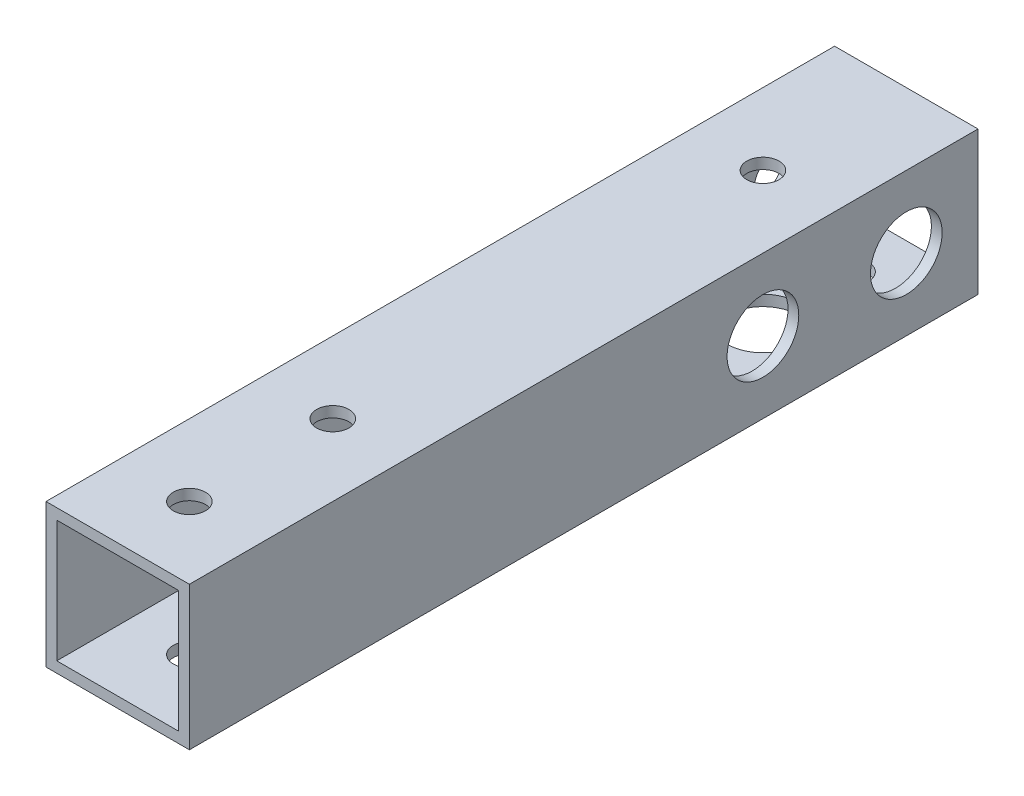
ISO-10303-21;
HEADER;
FILE_DESCRIPTION(('STEP AP214'),'2;1');
FILE_NAME('part.step','',(''),(''),'','','');
FILE_SCHEMA(('AUTOMOTIVE_DESIGN { 1 0 10303 214 1 1 1 1 }'));
ENDSEC;
DATA;
#1=APPLICATION_CONTEXT('core data for automotive mechanical design processes');
#2=APPLICATION_PROTOCOL_DEFINITION('international standard','automotive_design',2000,#1);
#3=PRODUCT_CONTEXT('',#1,'mechanical');
#4=PRODUCT('Part','Part','',(#3));
#5=PRODUCT_RELATED_PRODUCT_CATEGORY('part','',(#4));
#6=PRODUCT_DEFINITION_FORMATION('','',#4);
#7=PRODUCT_DEFINITION_CONTEXT('part definition',#1,'design');
#8=PRODUCT_DEFINITION('design','',#6,#7);
#9=PRODUCT_DEFINITION_SHAPE('','',#8);
#10=(LENGTH_UNIT() NAMED_UNIT(*) SI_UNIT(.MILLI.,.METRE.));
#11=(NAMED_UNIT(*) PLANE_ANGLE_UNIT() SI_UNIT($,.RADIAN.));
#12=(NAMED_UNIT(*) SI_UNIT($,.STERADIAN.) SOLID_ANGLE_UNIT());
#13=UNCERTAINTY_MEASURE_WITH_UNIT(LENGTH_MEASURE(1.E-05),#10,'distance_accuracy_value','');
#14=(GEOMETRIC_REPRESENTATION_CONTEXT(3) GLOBAL_UNCERTAINTY_ASSIGNED_CONTEXT((#13)) GLOBAL_UNIT_ASSIGNED_CONTEXT((#10,
#11,#12)) REPRESENTATION_CONTEXT('',''));
#15=CARTESIAN_POINT('',(0.,0.,0.));
#16=DIRECTION('',(0.,0.,1.));
#17=DIRECTION('',(1.,0.,0.));
#18=AXIS2_PLACEMENT_3D('',#15,#16,#17);
#19=CARTESIAN_POINT('',(0.,0.,110.));
#20=DIRECTION('',(0.,0.,-1.));
#21=DIRECTION('',(-1.,0.,0.));
#22=AXIS2_PLACEMENT_3D('',#19,#20,#21);
#23=PLANE('',#22);
#24=DIRECTION('',(0.,1.,0.));
#25=VECTOR('',#24,1.);
#26=CARTESIAN_POINT('',(10.,-10.,110.));
#27=LINE('',#26,#25);
#28=CARTESIAN_POINT('',(10.,-10.,110.));
#29=VERTEX_POINT('',#28);
#30=CARTESIAN_POINT('',(10.,10.,110.));
#31=VERTEX_POINT('',#30);
#32=EDGE_CURVE('E146',#29,#31,#27,.T.);
#33=ORIENTED_EDGE('',*,*,#32,.T.);
#34=DIRECTION('',(-1.,0.,0.));
#35=VECTOR('',#34,1.);
#36=CARTESIAN_POINT('',(-10.,10.,110.));
#37=LINE('',#36,#35);
#38=CARTESIAN_POINT('',(-10.,10.,110.));
#39=VERTEX_POINT('',#38);
#40=EDGE_CURVE('E149',#31,#39,#37,.T.);
#41=ORIENTED_EDGE('',*,*,#40,.T.);
#42=DIRECTION('',(0.,-1.,0.));
#43=VECTOR('',#42,1.);
#44=CARTESIAN_POINT('',(-10.,-10.,110.));
#45=LINE('',#44,#43);
#46=CARTESIAN_POINT('',(-10.,-10.,110.));
#47=VERTEX_POINT('',#46);
#48=EDGE_CURVE('E152',#39,#47,#45,.T.);
#49=ORIENTED_EDGE('',*,*,#48,.T.);
#50=DIRECTION('',(1.,0.,0.));
#51=VECTOR('',#50,1.);
#52=CARTESIAN_POINT('',(-10.,-10.,110.));
#53=LINE('',#52,#51);
#54=EDGE_CURVE('E154',#47,#29,#53,.T.);
#55=ORIENTED_EDGE('',*,*,#54,.T.);
#56=EDGE_LOOP('',(#33,#41,#49,#55));
#57=FACE_BOUND('',#56,.T.);
#58=DIRECTION('',(0.,1.,0.));
#59=VECTOR('',#58,1.);
#60=CARTESIAN_POINT('',(8.5,-8.5,110.));
#61=LINE('',#60,#59);
#62=CARTESIAN_POINT('',(8.5,-8.5,110.));
#63=VERTEX_POINT('',#62);
#64=CARTESIAN_POINT('',(8.5,8.5,110.));
#65=VERTEX_POINT('',#64);
#66=EDGE_CURVE('E108',#63,#65,#61,.T.);
#67=ORIENTED_EDGE('',*,*,#66,.F.);
#68=DIRECTION('',(1.,0.,0.));
#69=VECTOR('',#68,1.);
#70=CARTESIAN_POINT('',(-8.5,-8.5,110.));
#71=LINE('',#70,#69);
#72=CARTESIAN_POINT('',(-8.5,-8.5,110.));
#73=VERTEX_POINT('',#72);
#74=EDGE_CURVE('E130',#73,#63,#71,.T.);
#75=ORIENTED_EDGE('',*,*,#74,.F.);
#76=DIRECTION('',(0.,-1.,0.));
#77=VECTOR('',#76,1.);
#78=CARTESIAN_POINT('',(-8.5,-8.5,110.));
#79=LINE('',#78,#77);
#80=CARTESIAN_POINT('',(-8.5,8.5,110.));
#81=VERTEX_POINT('',#80);
#82=EDGE_CURVE('E128',#81,#73,#79,.T.);
#83=ORIENTED_EDGE('',*,*,#82,.F.);
#84=DIRECTION('',(-1.,0.,0.));
#85=VECTOR('',#84,1.);
#86=CARTESIAN_POINT('',(-8.5,8.5,110.));
#87=LINE('',#86,#85);
#88=EDGE_CURVE('E116',#65,#81,#87,.T.);
#89=ORIENTED_EDGE('',*,*,#88,.F.);
#90=EDGE_LOOP('',(#67,#75,#83,#89));
#91=FACE_BOUND('',#90,.T.);
#92=ADVANCED_FACE('F41',(#57,#91),#23,.F.);
#93=CARTESIAN_POINT('',(0.,0.,0.));
#94=DIRECTION('',(0.,0.,-1.));
#95=DIRECTION('',(-1.,0.,0.));
#96=AXIS2_PLACEMENT_3D('',#93,#94,#95);
#97=PLANE('',#96);
#98=DIRECTION('',(0.,1.,0.));
#99=VECTOR('',#98,1.);
#100=CARTESIAN_POINT('',(10.,-10.,0.));
#101=LINE('',#100,#99);
#102=CARTESIAN_POINT('',(10.,-10.,0.));
#103=VERTEX_POINT('',#102);
#104=CARTESIAN_POINT('',(10.,10.,0.));
#105=VERTEX_POINT('',#104);
#106=EDGE_CURVE('E124',#103,#105,#101,.T.);
#107=ORIENTED_EDGE('',*,*,#106,.F.);
#108=DIRECTION('',(1.,0.,0.));
#109=VECTOR('',#108,1.);
#110=CARTESIAN_POINT('',(-10.,-10.,0.));
#111=LINE('',#110,#109);
#112=CARTESIAN_POINT('',(-10.,-10.,0.));
#113=VERTEX_POINT('',#112);
#114=EDGE_CURVE('E150',#113,#103,#111,.T.);
#115=ORIENTED_EDGE('',*,*,#114,.F.);
#116=DIRECTION('',(0.,-1.,0.));
#117=VECTOR('',#116,1.);
#118=CARTESIAN_POINT('',(-10.,-10.,0.));
#119=LINE('',#118,#117);
#120=CARTESIAN_POINT('',(-10.,10.,0.));
#121=VERTEX_POINT('',#120);
#122=EDGE_CURVE('E161',#121,#113,#119,.T.);
#123=ORIENTED_EDGE('',*,*,#122,.F.);
#124=DIRECTION('',(-1.,0.,0.));
#125=VECTOR('',#124,1.);
#126=CARTESIAN_POINT('',(-10.,10.,0.));
#127=LINE('',#126,#125);
#128=EDGE_CURVE('E159',#105,#121,#127,.T.);
#129=ORIENTED_EDGE('',*,*,#128,.F.);
#130=EDGE_LOOP('',(#107,#115,#123,#129));
#131=FACE_BOUND('',#130,.T.);
#132=DIRECTION('',(1.,0.,0.));
#133=VECTOR('',#132,1.);
#134=CARTESIAN_POINT('',(-8.5,-8.5,0.));
#135=LINE('',#134,#133);
#136=CARTESIAN_POINT('',(-8.5,-8.5,0.));
#137=VERTEX_POINT('',#136);
#138=CARTESIAN_POINT('',(8.5,-8.5,0.));
#139=VERTEX_POINT('',#138);
#140=EDGE_CURVE('E117',#137,#139,#135,.T.);
#141=ORIENTED_EDGE('',*,*,#140,.T.);
#142=DIRECTION('',(0.,1.,0.));
#143=VECTOR('',#142,1.);
#144=CARTESIAN_POINT('',(8.5,-8.5,0.));
#145=LINE('',#144,#143);
#146=CARTESIAN_POINT('',(8.5,8.5,0.));
#147=VERTEX_POINT('',#146);
#148=EDGE_CURVE('E66',#139,#147,#145,.T.);
#149=ORIENTED_EDGE('',*,*,#148,.T.);
#150=DIRECTION('',(-1.,0.,0.));
#151=VECTOR('',#150,1.);
#152=CARTESIAN_POINT('',(-8.5,8.5,0.));
#153=LINE('',#152,#151);
#154=CARTESIAN_POINT('',(-8.5,8.5,0.));
#155=VERTEX_POINT('',#154);
#156=EDGE_CURVE('E123',#147,#155,#153,.T.);
#157=ORIENTED_EDGE('',*,*,#156,.T.);
#158=DIRECTION('',(0.,-1.,0.));
#159=VECTOR('',#158,1.);
#160=CARTESIAN_POINT('',(-8.5,-8.5,0.));
#161=LINE('',#160,#159);
#162=EDGE_CURVE('E138',#155,#137,#161,.T.);
#163=ORIENTED_EDGE('',*,*,#162,.T.);
#164=EDGE_LOOP('',(#141,#149,#157,#163));
#165=FACE_BOUND('',#164,.T.);
#166=ADVANCED_FACE('F260',(#131,#165),#97,.T.);
#167=CARTESIAN_POINT('',(10.,-10.,110.));
#168=DIRECTION('',(-1.,0.,0.));
#169=DIRECTION('',(0.,0.,1.));
#170=AXIS2_PLACEMENT_3D('',#167,#168,#169);
#171=PLANE('',#170);
#172=CARTESIAN_POINT('',(10.,0.,10.));
#173=DIRECTION('',(1.,0.,0.));
#174=DIRECTION('',(0.,0.,-1.));
#175=AXIS2_PLACEMENT_3D('',#172,#173,#174);
#176=CIRCLE('',#175,5.);
#177=CARTESIAN_POINT('',(10.,0.,5.));
#178=VERTEX_POINT('',#177);
#179=EDGE_CURVE('E197',#178,#178,#176,.T.);
#180=ORIENTED_EDGE('',*,*,#179,.F.);
#181=EDGE_LOOP('',(#180));
#182=FACE_BOUND('',#181,.T.);
#183=CARTESIAN_POINT('',(10.,0.,30.));
#184=DIRECTION('',(1.,0.,0.));
#185=DIRECTION('',(0.,0.,-1.));
#186=AXIS2_PLACEMENT_3D('',#183,#184,#185);
#187=CIRCLE('',#186,5.);
#188=CARTESIAN_POINT('',(10.,0.,25.));
#189=VERTEX_POINT('',#188);
#190=EDGE_CURVE('E202',#189,#189,#187,.T.);
#191=ORIENTED_EDGE('',*,*,#190,.F.);
#192=EDGE_LOOP('',(#191));
#193=FACE_BOUND('',#192,.T.);
#194=ORIENTED_EDGE('',*,*,#106,.T.);
#195=DIRECTION('',(0.,0.,-1.));
#196=VECTOR('',#195,1.);
#197=CARTESIAN_POINT('',(10.,10.,110.));
#198=LINE('',#197,#196);
#199=EDGE_CURVE('E11',#31,#105,#198,.T.);
#200=ORIENTED_EDGE('',*,*,#199,.F.);
#201=ORIENTED_EDGE('',*,*,#32,.F.);
#202=DIRECTION('',(0.,0.,-1.));
#203=VECTOR('',#202,1.);
#204=CARTESIAN_POINT('',(10.,-10.,110.));
#205=LINE('',#204,#203);
#206=EDGE_CURVE('E156',#29,#103,#205,.T.);
#207=ORIENTED_EDGE('',*,*,#206,.T.);
#208=EDGE_LOOP('',(#194,#200,#201,#207));
#209=FACE_BOUND('',#208,.T.);
#210=ADVANCED_FACE('F43',(#182,#193,#209),#171,.F.);
#211=CARTESIAN_POINT('',(-10.,10.,110.));
#212=DIRECTION('',(0.,-1.,0.));
#213=DIRECTION('',(0.,0.,-1.));
#214=AXIS2_PLACEMENT_3D('',#211,#212,#213);
#215=PLANE('',#214);
#216=CARTESIAN_POINT('',(0.,10.,100.));
#217=DIRECTION('',(0.,1.,0.));
#218=DIRECTION('',(0.,0.,1.));
#219=AXIS2_PLACEMENT_3D('',#216,#217,#218);
#220=CIRCLE('',#219,2.25);
#221=CARTESIAN_POINT('',(0.,10.,102.25));
#222=VERTEX_POINT('',#221);
#223=EDGE_CURVE('E216',#222,#222,#220,.T.);
#224=ORIENTED_EDGE('',*,*,#223,.F.);
#225=EDGE_LOOP('',(#224));
#226=FACE_BOUND('',#225,.T.);
#227=CARTESIAN_POINT('',(0.,10.,80.));
#228=DIRECTION('',(0.,1.,0.));
#229=DIRECTION('',(0.,0.,1.));
#230=AXIS2_PLACEMENT_3D('',#227,#228,#229);
#231=CIRCLE('',#230,2.25);
#232=CARTESIAN_POINT('',(0.,10.,82.25));
#233=VERTEX_POINT('',#232);
#234=EDGE_CURVE('E219',#233,#233,#231,.T.);
#235=ORIENTED_EDGE('',*,*,#234,.F.);
#236=EDGE_LOOP('',(#235));
#237=FACE_BOUND('',#236,.T.);
#238=CARTESIAN_POINT('',(-2.06718869533235E-13,10.,20.));
#239=DIRECTION('',(0.,1.,0.));
#240=DIRECTION('',(0.,0.,1.));
#241=AXIS2_PLACEMENT_3D('',#238,#239,#240);
#242=CIRCLE('',#241,2.25);
#243=CARTESIAN_POINT('',(-2.06718869533235E-13,10.,22.25));
#244=VERTEX_POINT('',#243);
#245=EDGE_CURVE('E190',#244,#244,#242,.T.);
#246=ORIENTED_EDGE('',*,*,#245,.F.);
#247=EDGE_LOOP('',(#246));
#248=FACE_BOUND('',#247,.T.);
#249=ORIENTED_EDGE('',*,*,#128,.T.);
#250=DIRECTION('',(0.,0.,-1.));
#251=VECTOR('',#250,1.);
#252=CARTESIAN_POINT('',(-10.,10.,110.));
#253=LINE('',#252,#251);
#254=EDGE_CURVE('E50',#39,#121,#253,.T.);
#255=ORIENTED_EDGE('',*,*,#254,.F.);
#256=ORIENTED_EDGE('',*,*,#40,.F.);
#257=ORIENTED_EDGE('',*,*,#199,.T.);
#258=EDGE_LOOP('',(#249,#255,#256,#257));
#259=FACE_BOUND('',#258,.T.);
#260=ADVANCED_FACE('F276',(#226,#237,#248,#259),#215,.F.);
#261=CARTESIAN_POINT('',(-10.,-10.,110.));
#262=DIRECTION('',(1.,0.,0.));
#263=DIRECTION('',(0.,0.,-1.));
#264=AXIS2_PLACEMENT_3D('',#261,#262,#263);
#265=PLANE('',#264);
#266=CARTESIAN_POINT('',(-10.,0.,10.));
#267=DIRECTION('',(1.,0.,0.));
#268=DIRECTION('',(0.,0.,-1.));
#269=AXIS2_PLACEMENT_3D('',#266,#267,#268);
#270=CIRCLE('',#269,2.7);
#271=CARTESIAN_POINT('',(-10.,0.,7.3));
#272=VERTEX_POINT('',#271);
#273=EDGE_CURVE('E136',#272,#272,#270,.T.);
#274=ORIENTED_EDGE('',*,*,#273,.T.);
#275=EDGE_LOOP('',(#274));
#276=FACE_BOUND('',#275,.T.);
#277=CARTESIAN_POINT('',(-10.,0.,30.));
#278=DIRECTION('',(1.,0.,0.));
#279=DIRECTION('',(0.,0.,-1.));
#280=AXIS2_PLACEMENT_3D('',#277,#278,#279);
#281=CIRCLE('',#280,2.7);
#282=CARTESIAN_POINT('',(-10.,0.,27.3));
#283=VERTEX_POINT('',#282);
#284=EDGE_CURVE('E174',#283,#283,#281,.T.);
#285=ORIENTED_EDGE('',*,*,#284,.T.);
#286=EDGE_LOOP('',(#285));
#287=FACE_BOUND('',#286,.T.);
#288=ORIENTED_EDGE('',*,*,#122,.T.);
#289=DIRECTION('',(0.,0.,-1.));
#290=VECTOR('',#289,1.);
#291=CARTESIAN_POINT('',(-10.,-10.,110.));
#292=LINE('',#291,#290);
#293=EDGE_CURVE('E166',#47,#113,#292,.T.);
#294=ORIENTED_EDGE('',*,*,#293,.F.);
#295=ORIENTED_EDGE('',*,*,#48,.F.);
#296=ORIENTED_EDGE('',*,*,#254,.T.);
#297=EDGE_LOOP('',(#288,#294,#295,#296));
#298=FACE_BOUND('',#297,.T.);
#299=ADVANCED_FACE('F237',(#276,#287,#298),#265,.F.);
#300=CARTESIAN_POINT('',(-10.,-10.,110.));
#301=DIRECTION('',(0.,1.,0.));
#302=DIRECTION('',(0.,0.,1.));
#303=AXIS2_PLACEMENT_3D('',#300,#301,#302);
#304=PLANE('',#303);
#305=CARTESIAN_POINT('',(-5.38458166943201E-12,-10.,20.0000000000006));
#306=DIRECTION('',(0.,-1.,0.));
#307=DIRECTION('',(0.,0.,-1.));
#308=AXIS2_PLACEMENT_3D('',#305,#306,#307);
#309=CIRCLE('',#308,5.);
#310=CARTESIAN_POINT('',(-5.38458166943201E-12,-10.,15.0000000000006));
#311=VERTEX_POINT('',#310);
#312=EDGE_CURVE('E194',#311,#311,#309,.T.);
#313=ORIENTED_EDGE('',*,*,#312,.F.);
#314=EDGE_LOOP('',(#313));
#315=FACE_BOUND('',#314,.T.);
#316=CARTESIAN_POINT('',(0.,-10.,7.5));
#317=DIRECTION('',(0.,-1.,0.));
#318=DIRECTION('',(0.,0.,-1.));
#319=AXIS2_PLACEMENT_3D('',#316,#317,#318);
#320=CIRCLE('',#319,2.25);
#321=CARTESIAN_POINT('',(0.,-10.,5.25));
#322=VERTEX_POINT('',#321);
#323=EDGE_CURVE('E191',#322,#322,#320,.T.);
#324=ORIENTED_EDGE('',*,*,#323,.F.);
#325=EDGE_LOOP('',(#324));
#326=FACE_BOUND('',#325,.T.);
#327=CARTESIAN_POINT('',(0.,-10.,100.));
#328=DIRECTION('',(0.,1.,0.));
#329=DIRECTION('',(0.,0.,1.));
#330=AXIS2_PLACEMENT_3D('',#327,#328,#329);
#331=CIRCLE('',#330,2.25);
#332=CARTESIAN_POINT('',(0.,-10.,102.25));
#333=VERTEX_POINT('',#332);
#334=EDGE_CURVE('E213',#333,#333,#331,.T.);
#335=ORIENTED_EDGE('',*,*,#334,.T.);
#336=EDGE_LOOP('',(#335));
#337=FACE_BOUND('',#336,.T.);
#338=CARTESIAN_POINT('',(0.,-10.,80.));
#339=DIRECTION('',(0.,1.,0.));
#340=DIRECTION('',(0.,0.,1.));
#341=AXIS2_PLACEMENT_3D('',#338,#339,#340);
#342=CIRCLE('',#341,2.25);
#343=CARTESIAN_POINT('',(0.,-10.,82.25));
#344=VERTEX_POINT('',#343);
#345=EDGE_CURVE('E222',#344,#344,#342,.T.);
#346=ORIENTED_EDGE('',*,*,#345,.T.);
#347=EDGE_LOOP('',(#346));
#348=FACE_BOUND('',#347,.T.);
#349=ORIENTED_EDGE('',*,*,#114,.T.);
#350=ORIENTED_EDGE('',*,*,#206,.F.);
#351=ORIENTED_EDGE('',*,*,#54,.F.);
#352=ORIENTED_EDGE('',*,*,#293,.T.);
#353=EDGE_LOOP('',(#349,#350,#351,#352));
#354=FACE_BOUND('',#353,.T.);
#355=ADVANCED_FACE('F271',(#315,#326,#337,#348,#354),#304,.F.);
#356=CARTESIAN_POINT('',(8.5,-8.5,110.));
#357=DIRECTION('',(-1.,0.,0.));
#358=DIRECTION('',(0.,0.,1.));
#359=AXIS2_PLACEMENT_3D('',#356,#357,#358);
#360=PLANE('',#359);
#361=CARTESIAN_POINT('',(8.5,0.,10.));
#362=DIRECTION('',(-1.,0.,0.));
#363=DIRECTION('',(0.,0.,1.));
#364=AXIS2_PLACEMENT_3D('',#361,#362,#363);
#365=CIRCLE('',#364,5.);
#366=CARTESIAN_POINT('',(8.5,0.,15.));
#367=VERTEX_POINT('',#366);
#368=EDGE_CURVE('E45',#367,#367,#365,.T.);
#369=ORIENTED_EDGE('',*,*,#368,.F.);
#370=EDGE_LOOP('',(#369));
#371=FACE_BOUND('',#370,.T.);
#372=CARTESIAN_POINT('',(8.5,0.,30.));
#373=DIRECTION('',(-1.,0.,0.));
#374=DIRECTION('',(0.,0.,1.));
#375=AXIS2_PLACEMENT_3D('',#372,#373,#374);
#376=CIRCLE('',#375,5.);
#377=CARTESIAN_POINT('',(8.5,0.,35.));
#378=VERTEX_POINT('',#377);
#379=EDGE_CURVE('E195',#378,#378,#376,.T.);
#380=ORIENTED_EDGE('',*,*,#379,.F.);
#381=EDGE_LOOP('',(#380));
#382=FACE_BOUND('',#381,.T.);
#383=ORIENTED_EDGE('',*,*,#148,.F.);
#384=DIRECTION('',(0.,0.,-1.));
#385=VECTOR('',#384,1.);
#386=CARTESIAN_POINT('',(8.5,-8.5,110.));
#387=LINE('',#386,#385);
#388=EDGE_CURVE('E112',#63,#139,#387,.T.);
#389=ORIENTED_EDGE('',*,*,#388,.F.);
#390=ORIENTED_EDGE('',*,*,#66,.T.);
#391=DIRECTION('',(0.,0.,-1.));
#392=VECTOR('',#391,1.);
#393=CARTESIAN_POINT('',(8.5,8.5,110.));
#394=LINE('',#393,#392);
#395=EDGE_CURVE('E111',#65,#147,#394,.T.);
#396=ORIENTED_EDGE('',*,*,#395,.T.);
#397=EDGE_LOOP('',(#383,#389,#390,#396));
#398=FACE_BOUND('',#397,.T.);
#399=ADVANCED_FACE('F110',(#371,#382,#398),#360,.T.);
#400=CARTESIAN_POINT('',(-8.5,8.5,110.));
#401=DIRECTION('',(0.,-1.,0.));
#402=DIRECTION('',(0.,0.,-1.));
#403=AXIS2_PLACEMENT_3D('',#400,#401,#402);
#404=PLANE('',#403);
#405=CARTESIAN_POINT('',(0.,8.5,100.));
#406=DIRECTION('',(0.,-1.,0.));
#407=DIRECTION('',(0.,0.,-1.));
#408=AXIS2_PLACEMENT_3D('',#405,#406,#407);
#409=CIRCLE('',#408,2.25);
#410=CARTESIAN_POINT('',(0.,8.5,97.75));
#411=VERTEX_POINT('',#410);
#412=EDGE_CURVE('E175',#411,#411,#409,.T.);
#413=ORIENTED_EDGE('',*,*,#412,.F.);
#414=EDGE_LOOP('',(#413));
#415=FACE_BOUND('',#414,.T.);
#416=CARTESIAN_POINT('',(0.,8.5,80.));
#417=DIRECTION('',(0.,-1.,0.));
#418=DIRECTION('',(0.,0.,-1.));
#419=AXIS2_PLACEMENT_3D('',#416,#417,#418);
#420=CIRCLE('',#419,2.25);
#421=CARTESIAN_POINT('',(0.,8.5,77.75));
#422=VERTEX_POINT('',#421);
#423=EDGE_CURVE('E182',#422,#422,#420,.T.);
#424=ORIENTED_EDGE('',*,*,#423,.F.);
#425=EDGE_LOOP('',(#424));
#426=FACE_BOUND('',#425,.T.);
#427=CARTESIAN_POINT('',(-2.06718869533235E-13,8.5,20.));
#428=DIRECTION('',(0.,-1.,0.));
#429=DIRECTION('',(0.,0.,-1.));
#430=AXIS2_PLACEMENT_3D('',#427,#428,#429);
#431=CIRCLE('',#430,2.25);
#432=CARTESIAN_POINT('',(-2.06718869533235E-13,8.5,17.75));
#433=VERTEX_POINT('',#432);
#434=EDGE_CURVE('E183',#433,#433,#431,.T.);
#435=ORIENTED_EDGE('',*,*,#434,.F.);
#436=EDGE_LOOP('',(#435));
#437=FACE_BOUND('',#436,.T.);
#438=ORIENTED_EDGE('',*,*,#156,.F.);
#439=ORIENTED_EDGE('',*,*,#395,.F.);
#440=ORIENTED_EDGE('',*,*,#88,.T.);
#441=DIRECTION('',(0.,0.,-1.));
#442=VECTOR('',#441,1.);
#443=CARTESIAN_POINT('',(-8.5,8.5,110.));
#444=LINE('',#443,#442);
#445=EDGE_CURVE('E125',#81,#155,#444,.T.);
#446=ORIENTED_EDGE('',*,*,#445,.T.);
#447=EDGE_LOOP('',(#438,#439,#440,#446));
#448=FACE_BOUND('',#447,.T.);
#449=ADVANCED_FACE('F120',(#415,#426,#437,#448),#404,.T.);
#450=CARTESIAN_POINT('',(-8.5,-8.5,110.));
#451=DIRECTION('',(1.,0.,0.));
#452=DIRECTION('',(0.,0.,-1.));
#453=AXIS2_PLACEMENT_3D('',#450,#451,#452);
#454=PLANE('',#453);
#455=CARTESIAN_POINT('',(-8.5,0.,10.));
#456=DIRECTION('',(1.,0.,0.));
#457=DIRECTION('',(0.,0.,-1.));
#458=AXIS2_PLACEMENT_3D('',#455,#456,#457);
#459=CIRCLE('',#458,2.7);
#460=CARTESIAN_POINT('',(-8.5,0.,7.3));
#461=VERTEX_POINT('',#460);
#462=EDGE_CURVE('E176',#461,#461,#459,.T.);
#463=ORIENTED_EDGE('',*,*,#462,.F.);
#464=EDGE_LOOP('',(#463));
#465=FACE_BOUND('',#464,.T.);
#466=CARTESIAN_POINT('',(-8.5,0.,30.));
#467=DIRECTION('',(1.,0.,0.));
#468=DIRECTION('',(0.,0.,-1.));
#469=AXIS2_PLACEMENT_3D('',#466,#467,#468);
#470=CIRCLE('',#469,2.7);
#471=CARTESIAN_POINT('',(-8.5,0.,27.3));
#472=VERTEX_POINT('',#471);
#473=EDGE_CURVE('E171',#472,#472,#470,.T.);
#474=ORIENTED_EDGE('',*,*,#473,.F.);
#475=EDGE_LOOP('',(#474));
#476=FACE_BOUND('',#475,.T.);
#477=ORIENTED_EDGE('',*,*,#162,.F.);
#478=ORIENTED_EDGE('',*,*,#445,.F.);
#479=ORIENTED_EDGE('',*,*,#82,.T.);
#480=DIRECTION('',(0.,0.,-1.));
#481=VECTOR('',#480,1.);
#482=CARTESIAN_POINT('',(-8.5,-8.5,110.));
#483=LINE('',#482,#481);
#484=EDGE_CURVE('E58',#73,#137,#483,.T.);
#485=ORIENTED_EDGE('',*,*,#484,.T.);
#486=EDGE_LOOP('',(#477,#478,#479,#485));
#487=FACE_BOUND('',#486,.T.);
#488=ADVANCED_FACE('F305',(#465,#476,#487),#454,.T.);
#489=CARTESIAN_POINT('',(-8.5,-8.5,110.));
#490=DIRECTION('',(0.,1.,0.));
#491=DIRECTION('',(0.,0.,1.));
#492=AXIS2_PLACEMENT_3D('',#489,#490,#491);
#493=PLANE('',#492);
#494=CARTESIAN_POINT('',(-5.38458166943201E-12,-8.5,20.0000000000006));
#495=DIRECTION('',(0.,1.,0.));
#496=DIRECTION('',(0.,0.,1.));
#497=AXIS2_PLACEMENT_3D('',#494,#495,#496);
#498=CIRCLE('',#497,5.);
#499=CARTESIAN_POINT('',(-5.38458166943201E-12,-8.5,25.0000000000006));
#500=VERTEX_POINT('',#499);
#501=EDGE_CURVE('E192',#500,#500,#498,.T.);
#502=ORIENTED_EDGE('',*,*,#501,.F.);
#503=EDGE_LOOP('',(#502));
#504=FACE_BOUND('',#503,.T.);
#505=CARTESIAN_POINT('',(0.,-8.5,7.5));
#506=DIRECTION('',(0.,1.,0.));
#507=DIRECTION('',(0.,0.,1.));
#508=AXIS2_PLACEMENT_3D('',#505,#506,#507);
#509=CIRCLE('',#508,2.25);
#510=CARTESIAN_POINT('',(0.,-8.5,9.75));
#511=VERTEX_POINT('',#510);
#512=EDGE_CURVE('E187',#511,#511,#509,.T.);
#513=ORIENTED_EDGE('',*,*,#512,.F.);
#514=EDGE_LOOP('',(#513));
#515=FACE_BOUND('',#514,.T.);
#516=CARTESIAN_POINT('',(0.,-8.5,100.));
#517=DIRECTION('',(0.,1.,0.));
#518=DIRECTION('',(0.,0.,1.));
#519=AXIS2_PLACEMENT_3D('',#516,#517,#518);
#520=CIRCLE('',#519,2.25);
#521=CARTESIAN_POINT('',(0.,-8.5,102.25));
#522=VERTEX_POINT('',#521);
#523=EDGE_CURVE('E184',#522,#522,#520,.T.);
#524=ORIENTED_EDGE('',*,*,#523,.F.);
#525=EDGE_LOOP('',(#524));
#526=FACE_BOUND('',#525,.T.);
#527=CARTESIAN_POINT('',(0.,-8.5,80.));
#528=DIRECTION('',(0.,1.,0.));
#529=DIRECTION('',(0.,0.,1.));
#530=AXIS2_PLACEMENT_3D('',#527,#528,#529);
#531=CIRCLE('',#530,2.25);
#532=CARTESIAN_POINT('',(0.,-8.5,82.25));
#533=VERTEX_POINT('',#532);
#534=EDGE_CURVE('E179',#533,#533,#531,.T.);
#535=ORIENTED_EDGE('',*,*,#534,.F.);
#536=EDGE_LOOP('',(#535));
#537=FACE_BOUND('',#536,.T.);
#538=ORIENTED_EDGE('',*,*,#140,.F.);
#539=ORIENTED_EDGE('',*,*,#484,.F.);
#540=ORIENTED_EDGE('',*,*,#74,.T.);
#541=ORIENTED_EDGE('',*,*,#388,.T.);
#542=EDGE_LOOP('',(#538,#539,#540,#541));
#543=FACE_BOUND('',#542,.T.);
#544=ADVANCED_FACE('F255',(#504,#515,#526,#537,#543),#493,.T.);
#545=CARTESIAN_POINT('',(-15.,0.,30.));
#546=DIRECTION('',(1.,0.,0.));
#547=DIRECTION('',(0.,0.,-1.));
#548=AXIS2_PLACEMENT_3D('',#545,#546,#547);
#549=CYLINDRICAL_SURFACE('',#548,2.7);
#550=ORIENTED_EDGE('',*,*,#473,.T.);
#551=EDGE_LOOP('',(#550));
#552=FACE_BOUND('',#551,.T.);
#553=ORIENTED_EDGE('',*,*,#284,.F.);
#554=EDGE_LOOP('',(#553));
#555=FACE_BOUND('',#554,.T.);
#556=ADVANCED_FACE('F243',(#552,#555),#549,.F.);
#557=CARTESIAN_POINT('',(-15.,0.,10.));
#558=DIRECTION('',(1.,0.,0.));
#559=DIRECTION('',(0.,0.,-1.));
#560=AXIS2_PLACEMENT_3D('',#557,#558,#559);
#561=CYLINDRICAL_SURFACE('',#560,2.7);
#562=ORIENTED_EDGE('',*,*,#462,.T.);
#563=EDGE_LOOP('',(#562));
#564=FACE_BOUND('',#563,.T.);
#565=ORIENTED_EDGE('',*,*,#273,.F.);
#566=EDGE_LOOP('',(#565));
#567=FACE_BOUND('',#566,.T.);
#568=ADVANCED_FACE('F240',(#564,#567),#561,.F.);
#569=CARTESIAN_POINT('',(0.,-10.,80.));
#570=DIRECTION('',(0.,1.,0.));
#571=DIRECTION('',(0.,0.,1.));
#572=AXIS2_PLACEMENT_3D('',#569,#570,#571);
#573=CYLINDRICAL_SURFACE('',#572,2.25);
#574=ORIENTED_EDGE('',*,*,#534,.T.);
#575=EDGE_LOOP('',(#574));
#576=FACE_BOUND('',#575,.T.);
#577=ORIENTED_EDGE('',*,*,#345,.F.);
#578=EDGE_LOOP('',(#577));
#579=FACE_BOUND('',#578,.T.);
#580=ADVANCED_FACE('F242',(#576,#579),#573,.F.);
#581=CARTESIAN_POINT('',(0.,-10.,100.));
#582=DIRECTION('',(0.,1.,0.));
#583=DIRECTION('',(0.,0.,1.));
#584=AXIS2_PLACEMENT_3D('',#581,#582,#583);
#585=CYLINDRICAL_SURFACE('',#584,2.25);
#586=ORIENTED_EDGE('',*,*,#523,.T.);
#587=EDGE_LOOP('',(#586));
#588=FACE_BOUND('',#587,.T.);
#589=ORIENTED_EDGE('',*,*,#334,.F.);
#590=EDGE_LOOP('',(#589));
#591=FACE_BOUND('',#590,.T.);
#592=ADVANCED_FACE('F251',(#588,#591),#585,.F.);
#593=CARTESIAN_POINT('',(-2.06718869533235E-13,-10.,20.));
#594=DIRECTION('',(0.,1.,0.));
#595=DIRECTION('',(0.,0.,1.));
#596=AXIS2_PLACEMENT_3D('',#593,#594,#595);
#597=CYLINDRICAL_SURFACE('',#596,2.25);
#598=ORIENTED_EDGE('',*,*,#434,.T.);
#599=EDGE_LOOP('',(#598));
#600=FACE_BOUND('',#599,.T.);
#601=ORIENTED_EDGE('',*,*,#245,.T.);
#602=EDGE_LOOP('',(#601));
#603=FACE_BOUND('',#602,.T.);
#604=ADVANCED_FACE('F327',(#600,#603),#597,.F.);
#605=ORIENTED_EDGE('',*,*,#423,.T.);
#606=EDGE_LOOP('',(#605));
#607=FACE_BOUND('',#606,.T.);
#608=ORIENTED_EDGE('',*,*,#234,.T.);
#609=EDGE_LOOP('',(#608));
#610=FACE_BOUND('',#609,.T.);
#611=ADVANCED_FACE('F254',(#607,#610),#573,.F.);
#612=ORIENTED_EDGE('',*,*,#412,.T.);
#613=EDGE_LOOP('',(#612));
#614=FACE_BOUND('',#613,.T.);
#615=ORIENTED_EDGE('',*,*,#223,.T.);
#616=EDGE_LOOP('',(#615));
#617=FACE_BOUND('',#616,.T.);
#618=ADVANCED_FACE('F334',(#614,#617),#585,.F.);
#619=CARTESIAN_POINT('',(0.,-5.,7.5));
#620=DIRECTION('',(0.,-1.,0.));
#621=DIRECTION('',(0.,0.,-1.));
#622=AXIS2_PLACEMENT_3D('',#619,#620,#621);
#623=CYLINDRICAL_SURFACE('',#622,2.25);
#624=ORIENTED_EDGE('',*,*,#512,.T.);
#625=EDGE_LOOP('',(#624));
#626=FACE_BOUND('',#625,.T.);
#627=ORIENTED_EDGE('',*,*,#323,.T.);
#628=EDGE_LOOP('',(#627));
#629=FACE_BOUND('',#628,.T.);
#630=ADVANCED_FACE('F339',(#626,#629),#623,.F.);
#631=CARTESIAN_POINT('',(-5.38458166943201E-12,0.,20.0000000000006));
#632=DIRECTION('',(0.,-1.,0.));
#633=DIRECTION('',(0.,0.,-1.));
#634=AXIS2_PLACEMENT_3D('',#631,#632,#633);
#635=CYLINDRICAL_SURFACE('',#634,5.);
#636=ORIENTED_EDGE('',*,*,#501,.T.);
#637=EDGE_LOOP('',(#636));
#638=FACE_BOUND('',#637,.T.);
#639=ORIENTED_EDGE('',*,*,#312,.T.);
#640=EDGE_LOOP('',(#639));
#641=FACE_BOUND('',#640,.T.);
#642=ADVANCED_FACE('F342',(#638,#641),#635,.F.);
#643=CARTESIAN_POINT('',(0.,0.,30.));
#644=DIRECTION('',(1.,0.,0.));
#645=DIRECTION('',(0.,0.,-1.));
#646=AXIS2_PLACEMENT_3D('',#643,#644,#645);
#647=CYLINDRICAL_SURFACE('',#646,5.);
#648=ORIENTED_EDGE('',*,*,#379,.T.);
#649=EDGE_LOOP('',(#648));
#650=FACE_BOUND('',#649,.T.);
#651=ORIENTED_EDGE('',*,*,#190,.T.);
#652=EDGE_LOOP('',(#651));
#653=FACE_BOUND('',#652,.T.);
#654=ADVANCED_FACE('F345',(#650,#653),#647,.F.);
#655=CARTESIAN_POINT('',(0.,0.,10.));
#656=DIRECTION('',(1.,0.,0.));
#657=DIRECTION('',(0.,0.,-1.));
#658=AXIS2_PLACEMENT_3D('',#655,#656,#657);
#659=CYLINDRICAL_SURFACE('',#658,5.);
#660=ORIENTED_EDGE('',*,*,#368,.T.);
#661=EDGE_LOOP('',(#660));
#662=FACE_BOUND('',#661,.T.);
#663=ORIENTED_EDGE('',*,*,#179,.T.);
#664=EDGE_LOOP('',(#663));
#665=FACE_BOUND('',#664,.T.);
#666=ADVANCED_FACE('F349',(#662,#665),#659,.F.);
#667=CLOSED_SHELL('',(#92,#166,#210,#260,#299,#355,#399,#449,#488,#544,#556,#568,#580,#592,#604,
#611,#618,#630,#642,#654,#666));
#668=MANIFOLD_SOLID_BREP('B2',#667);
#669=ADVANCED_BREP_SHAPE_REPRESENTATION('',(#18,#668),#14);
#670=SHAPE_DEFINITION_REPRESENTATION(#9,#669);
ENDSEC;
END-ISO-10303-21;
